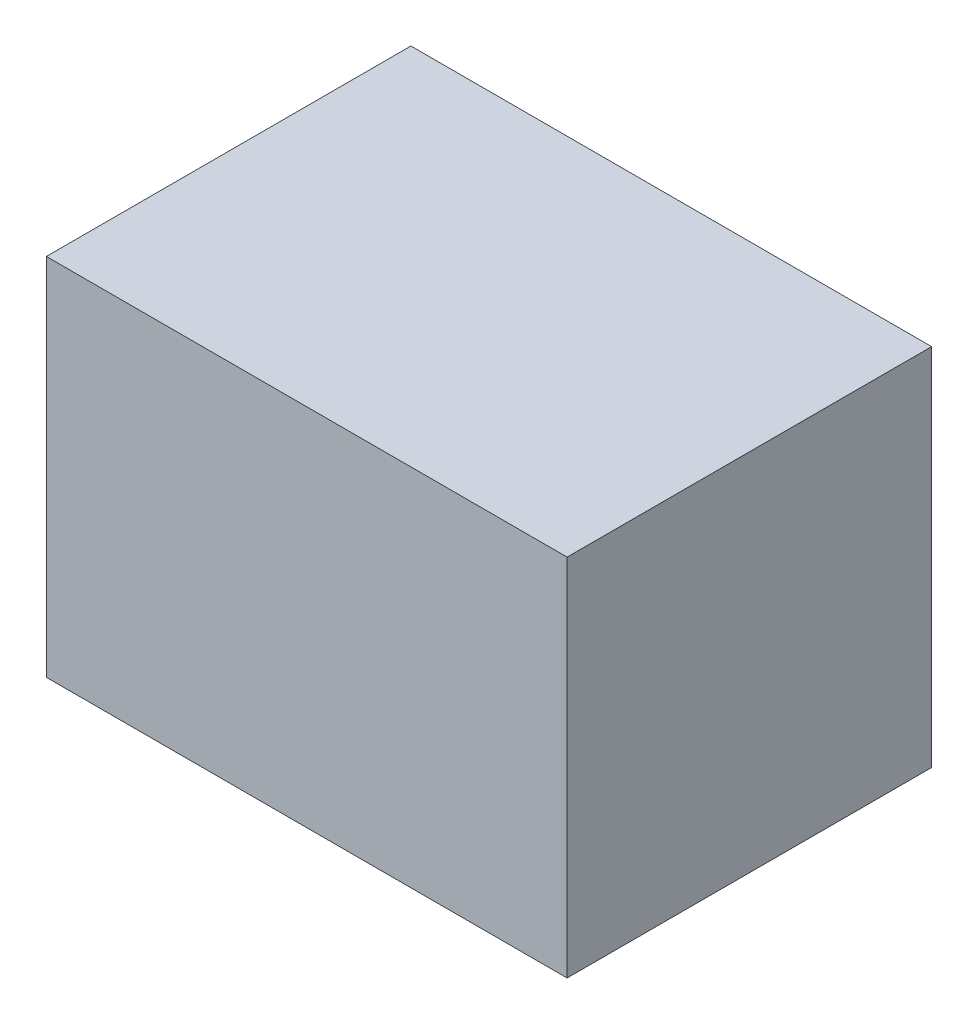
ISO-10303-21;
HEADER;
FILE_DESCRIPTION(('STEP AP214'),'2;1');
FILE_NAME('part.step','',(''),(''),'','','');
FILE_SCHEMA(('AUTOMOTIVE_DESIGN { 1 0 10303 214 1 1 1 1 }'));
ENDSEC;
DATA;
#1=APPLICATION_CONTEXT('core data for automotive mechanical design processes');
#2=APPLICATION_PROTOCOL_DEFINITION('international standard','automotive_design',2000,#1);
#3=PRODUCT_CONTEXT('',#1,'mechanical');
#4=PRODUCT('Part','Part','',(#3));
#5=PRODUCT_RELATED_PRODUCT_CATEGORY('part','',(#4));
#6=PRODUCT_DEFINITION_FORMATION('','',#4);
#7=PRODUCT_DEFINITION_CONTEXT('part definition',#1,'design');
#8=PRODUCT_DEFINITION('design','',#6,#7);
#9=PRODUCT_DEFINITION_SHAPE('','',#8);
#10=(LENGTH_UNIT() NAMED_UNIT(*) SI_UNIT(.MILLI.,.METRE.));
#11=(NAMED_UNIT(*) PLANE_ANGLE_UNIT() SI_UNIT($,.RADIAN.));
#12=(NAMED_UNIT(*) SI_UNIT($,.STERADIAN.) SOLID_ANGLE_UNIT());
#13=UNCERTAINTY_MEASURE_WITH_UNIT(LENGTH_MEASURE(1.E-05),#10,'distance_accuracy_value','');
#14=(GEOMETRIC_REPRESENTATION_CONTEXT(3) GLOBAL_UNCERTAINTY_ASSIGNED_CONTEXT((#13)) GLOBAL_UNIT_ASSIGNED_CONTEXT((#10,
#11,#12)) REPRESENTATION_CONTEXT('',''));
#15=CARTESIAN_POINT('',(0.,0.,0.));
#16=DIRECTION('',(0.,0.,1.));
#17=DIRECTION('',(1.,0.,0.));
#18=AXIS2_PLACEMENT_3D('',#15,#16,#17);
#19=CARTESIAN_POINT('',(-10.16,0.,0.));
#20=DIRECTION('',(0.,1.,0.));
#21=DIRECTION('',(1.,0.,0.));
#22=AXIS2_PLACEMENT_3D('',#19,#20,#21);
#23=PLANE('',#22);
#24=DIRECTION('',(0.,0.,1.));
#25=VECTOR('',#24,1.);
#26=CARTESIAN_POINT('',(4.83,0.,0.749999999999982));
#27=LINE('',#26,#25);
#28=CARTESIAN_POINT('',(4.83,0.,0.749999999999982));
#29=VERTEX_POINT('',#28);
#30=CARTESIAN_POINT('',(4.83,0.,1.1));
#31=VERTEX_POINT('',#30);
#32=EDGE_CURVE('E82',#29,#31,#27,.T.);
#33=ORIENTED_EDGE('',*,*,#32,.T.);
#34=DIRECTION('',(1.,0.,0.));
#35=VECTOR('',#34,1.);
#36=CARTESIAN_POINT('',(4.83,0.,1.1));
#37=LINE('',#36,#35);
#38=CARTESIAN_POINT('',(5.33,0.,1.1));
#39=VERTEX_POINT('',#38);
#40=EDGE_CURVE('E26',#31,#39,#37,.T.);
#41=ORIENTED_EDGE('',*,*,#40,.T.);
#42=DIRECTION('',(0.,0.,1.));
#43=VECTOR('',#42,1.);
#44=CARTESIAN_POINT('',(5.33,0.,0.749999999999982));
#45=LINE('',#44,#43);
#46=CARTESIAN_POINT('',(5.33,0.,0.749999999999982));
#47=VERTEX_POINT('',#46);
#48=EDGE_CURVE('E84',#47,#39,#45,.T.);
#49=ORIENTED_EDGE('',*,*,#48,.F.);
#50=DIRECTION('',(1.,0.,0.));
#51=VECTOR('',#50,1.);
#52=CARTESIAN_POINT('',(4.83,0.,0.749999999999982));
#53=LINE('',#52,#51);
#54=EDGE_CURVE('E80',#29,#47,#53,.T.);
#55=ORIENTED_EDGE('',*,*,#54,.F.);
#56=EDGE_LOOP('',(#33,#41,#49,#55));
#57=FACE_BOUND('',#56,.T.);
#58=ADVANCED_FACE('F16',(#57),#23,.T.);
#59=CARTESIAN_POINT('',(-10.16,-0.35,0.));
#60=DIRECTION('',(0.,1.,0.));
#61=DIRECTION('',(1.,0.,0.));
#62=AXIS2_PLACEMENT_3D('',#59,#60,#61);
#63=PLANE('',#62);
#64=DIRECTION('',(0.,0.,1.));
#65=VECTOR('',#64,1.);
#66=CARTESIAN_POINT('',(4.83,-0.35,0.749999999999982));
#67=LINE('',#66,#65);
#68=CARTESIAN_POINT('',(4.83,-0.35,0.749999999999982));
#69=VERTEX_POINT('',#68);
#70=CARTESIAN_POINT('',(4.83,-0.35,1.1));
#71=VERTEX_POINT('',#70);
#72=EDGE_CURVE('E95',#69,#71,#67,.T.);
#73=ORIENTED_EDGE('',*,*,#72,.F.);
#74=DIRECTION('',(1.,0.,0.));
#75=VECTOR('',#74,1.);
#76=CARTESIAN_POINT('',(4.83,-0.35,0.749999999999982));
#77=LINE('',#76,#75);
#78=CARTESIAN_POINT('',(5.33,-0.35,0.749999999999982));
#79=VERTEX_POINT('',#78);
#80=EDGE_CURVE('E66',#69,#79,#77,.T.);
#81=ORIENTED_EDGE('',*,*,#80,.T.);
#82=DIRECTION('',(0.,0.,1.));
#83=VECTOR('',#82,1.);
#84=CARTESIAN_POINT('',(5.33,-0.35,0.749999999999982));
#85=LINE('',#84,#83);
#86=CARTESIAN_POINT('',(5.33,-0.35,1.1));
#87=VERTEX_POINT('',#86);
#88=EDGE_CURVE('E107',#79,#87,#85,.T.);
#89=ORIENTED_EDGE('',*,*,#88,.T.);
#90=DIRECTION('',(1.,0.,0.));
#91=VECTOR('',#90,1.);
#92=CARTESIAN_POINT('',(4.83,-0.35,1.1));
#93=LINE('',#92,#91);
#94=EDGE_CURVE('E11',#71,#87,#93,.T.);
#95=ORIENTED_EDGE('',*,*,#94,.F.);
#96=EDGE_LOOP('',(#73,#81,#89,#95));
#97=FACE_BOUND('',#96,.T.);
#98=ADVANCED_FACE('F121',(#97),#63,.F.);
#99=CARTESIAN_POINT('',(4.83,-0.35,1.1));
#100=DIRECTION('',(0.,0.,1.));
#101=DIRECTION('',(1.,0.,0.));
#102=AXIS2_PLACEMENT_3D('',#99,#100,#101);
#103=PLANE('',#102);
#104=ORIENTED_EDGE('',*,*,#40,.F.);
#105=DIRECTION('',(0.,1.,0.));
#106=VECTOR('',#105,1.);
#107=CARTESIAN_POINT('',(4.83,-0.35,1.1));
#108=LINE('',#107,#106);
#109=EDGE_CURVE('E19',#71,#31,#108,.T.);
#110=ORIENTED_EDGE('',*,*,#109,.F.);
#111=ORIENTED_EDGE('',*,*,#94,.T.);
#112=DIRECTION('',(0.,1.,0.));
#113=VECTOR('',#112,1.);
#114=CARTESIAN_POINT('',(5.33,-0.35,1.1));
#115=LINE('',#114,#113);
#116=EDGE_CURVE('E109',#87,#39,#115,.T.);
#117=ORIENTED_EDGE('',*,*,#116,.T.);
#118=EDGE_LOOP('',(#104,#110,#111,#117));
#119=FACE_BOUND('',#118,.T.);
#120=ADVANCED_FACE('F125',(#119),#103,.T.);
#121=CARTESIAN_POINT('',(5.33,-0.35,0.749999999999982));
#122=DIRECTION('',(-1.,0.,0.));
#123=DIRECTION('',(0.,0.,1.));
#124=AXIS2_PLACEMENT_3D('',#121,#122,#123);
#125=PLANE('',#124);
#126=ORIENTED_EDGE('',*,*,#48,.T.);
#127=ORIENTED_EDGE('',*,*,#116,.F.);
#128=ORIENTED_EDGE('',*,*,#88,.F.);
#129=DIRECTION('',(0.,1.,0.));
#130=VECTOR('',#129,1.);
#131=CARTESIAN_POINT('',(5.33,-0.35,0.749999999999982));
#132=LINE('',#131,#130);
#133=EDGE_CURVE('E87',#79,#47,#132,.T.);
#134=ORIENTED_EDGE('',*,*,#133,.T.);
#135=EDGE_LOOP('',(#126,#127,#128,#134));
#136=FACE_BOUND('',#135,.T.);
#137=ADVANCED_FACE('F124',(#136),#125,.F.);
#138=CARTESIAN_POINT('',(4.83,-0.35,0.749999999999982));
#139=DIRECTION('',(0.,0.,1.));
#140=DIRECTION('',(1.,0.,0.));
#141=AXIS2_PLACEMENT_3D('',#138,#139,#140);
#142=PLANE('',#141);
#143=ORIENTED_EDGE('',*,*,#54,.T.);
#144=ORIENTED_EDGE('',*,*,#133,.F.);
#145=ORIENTED_EDGE('',*,*,#80,.F.);
#146=DIRECTION('',(0.,1.,0.));
#147=VECTOR('',#146,1.);
#148=CARTESIAN_POINT('',(4.83,-0.35,0.749999999999982));
#149=LINE('',#148,#147);
#150=EDGE_CURVE('E90',#69,#29,#149,.T.);
#151=ORIENTED_EDGE('',*,*,#150,.T.);
#152=EDGE_LOOP('',(#143,#144,#145,#151));
#153=FACE_BOUND('',#152,.T.);
#154=ADVANCED_FACE('F91',(#153),#142,.F.);
#155=CARTESIAN_POINT('',(4.83,-0.35,0.749999999999982));
#156=DIRECTION('',(-1.,0.,0.));
#157=DIRECTION('',(0.,0.,1.));
#158=AXIS2_PLACEMENT_3D('',#155,#156,#157);
#159=PLANE('',#158);
#160=ORIENTED_EDGE('',*,*,#32,.F.);
#161=ORIENTED_EDGE('',*,*,#150,.F.);
#162=ORIENTED_EDGE('',*,*,#72,.T.);
#163=ORIENTED_EDGE('',*,*,#109,.T.);
#164=EDGE_LOOP('',(#160,#161,#162,#163));
#165=FACE_BOUND('',#164,.T.);
#166=ADVANCED_FACE('F97',(#165),#159,.T.);
#167=CLOSED_SHELL('',(#58,#98,#120,#137,#154,#166));
#168=MANIFOLD_SOLID_BREP('B1',#167);
#169=ADVANCED_BREP_SHAPE_REPRESENTATION('',(#18,#168),#14);
#170=SHAPE_DEFINITION_REPRESENTATION(#9,#169);
ENDSEC;
END-ISO-10303-21;
